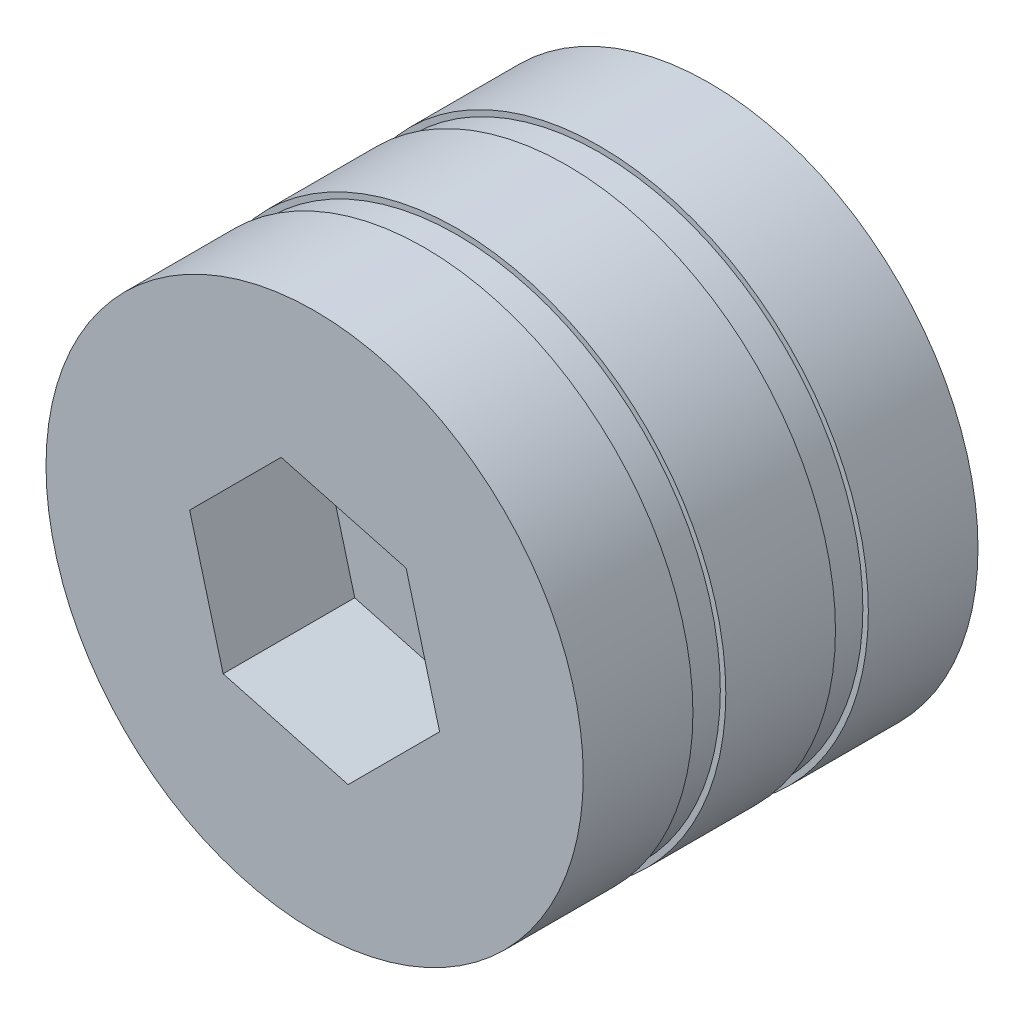
ISO-10303-21;
HEADER;
FILE_DESCRIPTION(('STEP AP214'),'2;1');
FILE_NAME('part.step','',(''),(''),'','','');
FILE_SCHEMA(('AUTOMOTIVE_DESIGN { 1 0 10303 214 1 1 1 1 }'));
ENDSEC;
DATA;
#1=APPLICATION_CONTEXT('core data for automotive mechanical design processes');
#2=APPLICATION_PROTOCOL_DEFINITION('international standard','automotive_design',2000,#1);
#3=PRODUCT_CONTEXT('',#1,'mechanical');
#4=PRODUCT('Part','Part','',(#3));
#5=PRODUCT_RELATED_PRODUCT_CATEGORY('part','',(#4));
#6=PRODUCT_DEFINITION_FORMATION('','',#4);
#7=PRODUCT_DEFINITION_CONTEXT('part definition',#1,'design');
#8=PRODUCT_DEFINITION('design','',#6,#7);
#9=PRODUCT_DEFINITION_SHAPE('','',#8);
#10=(LENGTH_UNIT() NAMED_UNIT(*) SI_UNIT(.MILLI.,.METRE.));
#11=(NAMED_UNIT(*) PLANE_ANGLE_UNIT() SI_UNIT($,.RADIAN.));
#12=(NAMED_UNIT(*) SI_UNIT($,.STERADIAN.) SOLID_ANGLE_UNIT());
#13=UNCERTAINTY_MEASURE_WITH_UNIT(LENGTH_MEASURE(1.E-05),#10,'distance_accuracy_value','');
#14=(GEOMETRIC_REPRESENTATION_CONTEXT(3) GLOBAL_UNCERTAINTY_ASSIGNED_CONTEXT((#13)) GLOBAL_UNIT_ASSIGNED_CONTEXT((#10,
#11,#12)) REPRESENTATION_CONTEXT('',''));
#15=CARTESIAN_POINT('',(0.,0.,0.));
#16=DIRECTION('',(0.,0.,1.));
#17=DIRECTION('',(1.,0.,0.));
#18=AXIS2_PLACEMENT_3D('',#15,#16,#17);
#19=CARTESIAN_POINT('',(0.,0.,36.));
#20=DIRECTION('',(0.,0.,-1.));
#21=DIRECTION('',(-1.,0.,0.));
#22=AXIS2_PLACEMENT_3D('',#19,#20,#21);
#23=CYLINDRICAL_SURFACE('',#22,24.5);
#24=CARTESIAN_POINT('',(0.,0.,26.));
#25=DIRECTION('',(0.,0.,1.));
#26=DIRECTION('',(1.,0.,0.));
#27=AXIS2_PLACEMENT_3D('',#24,#25,#26);
#28=CIRCLE('',#27,24.5);
#29=CARTESIAN_POINT('',(24.5,0.,26.));
#30=VERTEX_POINT('',#29);
#31=EDGE_CURVE('E155',#30,#30,#28,.T.);
#32=ORIENTED_EDGE('',*,*,#31,.T.);
#33=EDGE_LOOP('',(#32));
#34=FACE_BOUND('',#33,.T.);
#35=CARTESIAN_POINT('',(0.,0.,36.));
#36=DIRECTION('',(0.,0.,1.));
#37=DIRECTION('',(1.,0.,0.));
#38=AXIS2_PLACEMENT_3D('',#35,#36,#37);
#39=CIRCLE('',#38,24.5);
#40=CARTESIAN_POINT('',(24.5,0.,36.));
#41=VERTEX_POINT('',#40);
#42=EDGE_CURVE('E11',#41,#41,#39,.T.);
#43=ORIENTED_EDGE('',*,*,#42,.F.);
#44=EDGE_LOOP('',(#43));
#45=FACE_BOUND('',#44,.T.);
#46=ADVANCED_FACE('F37',(#34,#45),#23,.T.);
#47=CARTESIAN_POINT('',(0.,0.,36.));
#48=DIRECTION('',(0.,0.,1.));
#49=DIRECTION('',(1.,0.,0.));
#50=AXIS2_PLACEMENT_3D('',#47,#48,#49);
#51=PLANE('',#50);
#52=DIRECTION('',(-0.258819045102521,0.965925826289068,0.));
#53=VECTOR('',#52,1.);
#54=CARTESIAN_POINT('',(11.397924750211,-3.05406473220975,36.));
#55=LINE('',#54,#53);
#56=CARTESIAN_POINT('',(11.397924750211,-3.05406473220975,36.));
#57=VERTEX_POINT('',#56);
#58=CARTESIAN_POINT('',(8.34386001800126,8.34386001800126,36.));
#59=VERTEX_POINT('',#58);
#60=EDGE_CURVE('E51',#57,#59,#55,.T.);
#61=ORIENTED_EDGE('',*,*,#60,.F.);
#62=DIRECTION('',(0.707106781186547,0.707106781186548,0.));
#63=VECTOR('',#62,1.);
#64=CARTESIAN_POINT('',(3.05406473220975,-11.397924750211,36.));
#65=LINE('',#64,#63);
#66=CARTESIAN_POINT('',(3.05406473220975,-11.397924750211,36.));
#67=VERTEX_POINT('',#66);
#68=EDGE_CURVE('E135',#67,#57,#65,.T.);
#69=ORIENTED_EDGE('',*,*,#68,.F.);
#70=DIRECTION('',(0.965925826289068,-0.258819045102521,0.));
#71=VECTOR('',#70,1.);
#72=CARTESIAN_POINT('',(-8.34386001800126,-8.34386001800126,36.));
#73=LINE('',#72,#71);
#74=CARTESIAN_POINT('',(-8.34386001800126,-8.34386001800126,36.));
#75=VERTEX_POINT('',#74);
#76=EDGE_CURVE('E133',#75,#67,#73,.T.);
#77=ORIENTED_EDGE('',*,*,#76,.F.);
#78=DIRECTION('',(0.258819045102521,-0.965925826289068,0.));
#79=VECTOR('',#78,1.);
#80=CARTESIAN_POINT('',(-11.397924750211,3.05406473220974,36.));
#81=LINE('',#80,#79);
#82=CARTESIAN_POINT('',(-11.397924750211,3.05406473220974,36.));
#83=VERTEX_POINT('',#82);
#84=EDGE_CURVE('E99',#83,#75,#81,.T.);
#85=ORIENTED_EDGE('',*,*,#84,.F.);
#86=DIRECTION('',(-0.707106781186547,-0.707106781186547,0.));
#87=VECTOR('',#86,1.);
#88=CARTESIAN_POINT('',(-3.05406473220974,11.397924750211,36.));
#89=LINE('',#88,#87);
#90=CARTESIAN_POINT('',(-3.05406473220974,11.397924750211,36.));
#91=VERTEX_POINT('',#90);
#92=EDGE_CURVE('E129',#91,#83,#89,.T.);
#93=ORIENTED_EDGE('',*,*,#92,.F.);
#94=DIRECTION('',(-0.965925826289068,0.258819045102521,0.));
#95=VECTOR('',#94,1.);
#96=CARTESIAN_POINT('',(8.34386001800126,8.34386001800126,36.));
#97=LINE('',#96,#95);
#98=EDGE_CURVE('E125',#59,#91,#97,.T.);
#99=ORIENTED_EDGE('',*,*,#98,.F.);
#100=EDGE_LOOP('',(#61,#69,#77,#85,#93,#99));
#101=FACE_BOUND('',#100,.T.);
#102=ORIENTED_EDGE('',*,*,#42,.T.);
#103=EDGE_LOOP('',(#102));
#104=FACE_BOUND('',#103,.T.);
#105=ADVANCED_FACE('F148',(#101,#104),#51,.T.);
#106=CARTESIAN_POINT('',(11.397924750211,-3.05406473220975,24.));
#107=DIRECTION('',(0.965925826289068,0.258819045102521,0.));
#108=DIRECTION('',(-0.258819045102521,0.965925826289068,0.));
#109=AXIS2_PLACEMENT_3D('',#106,#107,#108);
#110=PLANE('',#109);
#111=ORIENTED_EDGE('',*,*,#60,.T.);
#112=DIRECTION('',(0.,0.,1.));
#113=VECTOR('',#112,1.);
#114=CARTESIAN_POINT('',(8.34386001800126,8.34386001800126,24.));
#115=LINE('',#114,#113);
#116=CARTESIAN_POINT('',(8.34386001800126,8.34386001800126,24.));
#117=VERTEX_POINT('',#116);
#118=EDGE_CURVE('E81',#117,#59,#115,.T.);
#119=ORIENTED_EDGE('',*,*,#118,.F.);
#120=DIRECTION('',(-0.258819045102521,0.965925826289068,0.));
#121=VECTOR('',#120,1.);
#122=CARTESIAN_POINT('',(11.397924750211,-3.05406473220975,24.));
#123=LINE('',#122,#121);
#124=CARTESIAN_POINT('',(11.397924750211,-3.05406473220975,24.));
#125=VERTEX_POINT('',#124);
#126=EDGE_CURVE('E137',#125,#117,#123,.T.);
#127=ORIENTED_EDGE('',*,*,#126,.F.);
#128=DIRECTION('',(0.,0.,1.));
#129=VECTOR('',#128,1.);
#130=CARTESIAN_POINT('',(11.397924750211,-3.05406473220975,24.));
#131=LINE('',#130,#129);
#132=EDGE_CURVE('E59',#125,#57,#131,.T.);
#133=ORIENTED_EDGE('',*,*,#132,.T.);
#134=EDGE_LOOP('',(#111,#119,#127,#133));
#135=FACE_BOUND('',#134,.T.);
#136=ADVANCED_FACE('F207',(#135),#110,.F.);
#137=CARTESIAN_POINT('',(3.05406473220975,-11.397924750211,24.));
#138=DIRECTION('',(0.707106781186548,-0.707106781186547,0.));
#139=DIRECTION('',(0.707106781186547,0.707106781186548,0.));
#140=AXIS2_PLACEMENT_3D('',#137,#138,#139);
#141=PLANE('',#140);
#142=ORIENTED_EDGE('',*,*,#68,.T.);
#143=ORIENTED_EDGE('',*,*,#132,.F.);
#144=DIRECTION('',(0.707106781186547,0.707106781186548,0.));
#145=VECTOR('',#144,1.);
#146=CARTESIAN_POINT('',(3.05406473220975,-11.397924750211,24.));
#147=LINE('',#146,#145);
#148=CARTESIAN_POINT('',(3.05406473220975,-11.397924750211,24.));
#149=VERTEX_POINT('',#148);
#150=EDGE_CURVE('E111',#149,#125,#147,.T.);
#151=ORIENTED_EDGE('',*,*,#150,.F.);
#152=DIRECTION('',(0.,0.,1.));
#153=VECTOR('',#152,1.);
#154=CARTESIAN_POINT('',(3.05406473220975,-11.397924750211,24.));
#155=LINE('',#154,#153);
#156=EDGE_CURVE('E103',#149,#67,#155,.T.);
#157=ORIENTED_EDGE('',*,*,#156,.T.);
#158=EDGE_LOOP('',(#142,#143,#151,#157));
#159=FACE_BOUND('',#158,.T.);
#160=ADVANCED_FACE('F229',(#159),#141,.F.);
#161=CARTESIAN_POINT('',(-8.34386001800126,-8.34386001800126,24.));
#162=DIRECTION('',(-0.258819045102521,-0.965925826289068,0.));
#163=DIRECTION('',(0.965925826289068,-0.258819045102521,0.));
#164=AXIS2_PLACEMENT_3D('',#161,#162,#163);
#165=PLANE('',#164);
#166=ORIENTED_EDGE('',*,*,#76,.T.);
#167=ORIENTED_EDGE('',*,*,#156,.F.);
#168=DIRECTION('',(0.965925826289068,-0.258819045102521,0.));
#169=VECTOR('',#168,1.);
#170=CARTESIAN_POINT('',(-8.34386001800126,-8.34386001800126,24.));
#171=LINE('',#170,#169);
#172=CARTESIAN_POINT('',(-8.34386001800126,-8.34386001800126,24.));
#173=VERTEX_POINT('',#172);
#174=EDGE_CURVE('E107',#173,#149,#171,.T.);
#175=ORIENTED_EDGE('',*,*,#174,.F.);
#176=DIRECTION('',(0.,0.,1.));
#177=VECTOR('',#176,1.);
#178=CARTESIAN_POINT('',(-8.34386001800126,-8.34386001800126,24.));
#179=LINE('',#178,#177);
#180=EDGE_CURVE('E92',#173,#75,#179,.T.);
#181=ORIENTED_EDGE('',*,*,#180,.T.);
#182=EDGE_LOOP('',(#166,#167,#175,#181));
#183=FACE_BOUND('',#182,.T.);
#184=ADVANCED_FACE('F108',(#183),#165,.F.);
#185=CARTESIAN_POINT('',(-11.397924750211,3.05406473220974,24.));
#186=DIRECTION('',(-0.965925826289068,-0.258819045102521,0.));
#187=DIRECTION('',(0.258819045102521,-0.965925826289068,0.));
#188=AXIS2_PLACEMENT_3D('',#185,#186,#187);
#189=PLANE('',#188);
#190=ORIENTED_EDGE('',*,*,#84,.T.);
#191=ORIENTED_EDGE('',*,*,#180,.F.);
#192=DIRECTION('',(0.258819045102521,-0.965925826289068,0.));
#193=VECTOR('',#192,1.);
#194=CARTESIAN_POINT('',(-11.397924750211,3.05406473220974,24.));
#195=LINE('',#194,#193);
#196=CARTESIAN_POINT('',(-11.397924750211,3.05406473220974,24.));
#197=VERTEX_POINT('',#196);
#198=EDGE_CURVE('E96',#197,#173,#195,.T.);
#199=ORIENTED_EDGE('',*,*,#198,.F.);
#200=DIRECTION('',(0.,0.,1.));
#201=VECTOR('',#200,1.);
#202=CARTESIAN_POINT('',(-11.397924750211,3.05406473220974,24.));
#203=LINE('',#202,#201);
#204=EDGE_CURVE('E104',#197,#83,#203,.T.);
#205=ORIENTED_EDGE('',*,*,#204,.T.);
#206=EDGE_LOOP('',(#190,#191,#199,#205));
#207=FACE_BOUND('',#206,.T.);
#208=ADVANCED_FACE('F94',(#207),#189,.F.);
#209=CARTESIAN_POINT('',(-3.05406473220974,11.397924750211,24.));
#210=DIRECTION('',(-0.707106781186548,0.707106781186548,0.));
#211=DIRECTION('',(-0.707106781186548,-0.707106781186548,0.));
#212=AXIS2_PLACEMENT_3D('',#209,#210,#211);
#213=PLANE('',#212);
#214=ORIENTED_EDGE('',*,*,#92,.T.);
#215=ORIENTED_EDGE('',*,*,#204,.F.);
#216=DIRECTION('',(-0.707106781186547,-0.707106781186547,0.));
#217=VECTOR('',#216,1.);
#218=CARTESIAN_POINT('',(-3.05406473220974,11.397924750211,24.));
#219=LINE('',#218,#217);
#220=CARTESIAN_POINT('',(-3.05406473220974,11.397924750211,24.));
#221=VERTEX_POINT('',#220);
#222=EDGE_CURVE('E117',#221,#197,#219,.T.);
#223=ORIENTED_EDGE('',*,*,#222,.F.);
#224=DIRECTION('',(0.,0.,1.));
#225=VECTOR('',#224,1.);
#226=CARTESIAN_POINT('',(-3.05406473220974,11.397924750211,24.));
#227=LINE('',#226,#225);
#228=EDGE_CURVE('E141',#221,#91,#227,.T.);
#229=ORIENTED_EDGE('',*,*,#228,.T.);
#230=EDGE_LOOP('',(#214,#215,#223,#229));
#231=FACE_BOUND('',#230,.T.);
#232=ADVANCED_FACE('F152',(#231),#213,.F.);
#233=CARTESIAN_POINT('',(8.34386001800126,8.34386001800126,24.));
#234=DIRECTION('',(0.258819045102521,0.965925826289068,0.));
#235=DIRECTION('',(-0.965925826289068,0.258819045102521,0.));
#236=AXIS2_PLACEMENT_3D('',#233,#234,#235);
#237=PLANE('',#236);
#238=ORIENTED_EDGE('',*,*,#98,.T.);
#239=ORIENTED_EDGE('',*,*,#228,.F.);
#240=DIRECTION('',(-0.965925826289068,0.258819045102521,0.));
#241=VECTOR('',#240,1.);
#242=CARTESIAN_POINT('',(8.34386001800126,8.34386001800126,24.));
#243=LINE('',#242,#241);
#244=EDGE_CURVE('E119',#117,#221,#243,.T.);
#245=ORIENTED_EDGE('',*,*,#244,.F.);
#246=ORIENTED_EDGE('',*,*,#118,.T.);
#247=EDGE_LOOP('',(#238,#239,#245,#246));
#248=FACE_BOUND('',#247,.T.);
#249=ADVANCED_FACE('F145',(#248),#237,.F.);
#250=CARTESIAN_POINT('',(0.,0.,24.));
#251=DIRECTION('',(0.,0.,1.));
#252=DIRECTION('',(1.,0.,0.));
#253=AXIS2_PLACEMENT_3D('',#250,#251,#252);
#254=PLANE('',#253);
#255=ORIENTED_EDGE('',*,*,#126,.T.);
#256=ORIENTED_EDGE('',*,*,#244,.T.);
#257=ORIENTED_EDGE('',*,*,#222,.T.);
#258=ORIENTED_EDGE('',*,*,#198,.T.);
#259=ORIENTED_EDGE('',*,*,#174,.T.);
#260=ORIENTED_EDGE('',*,*,#150,.T.);
#261=EDGE_LOOP('',(#255,#256,#257,#258,#259,#260));
#262=FACE_BOUND('',#261,.T.);
#263=ADVANCED_FACE('F114',(#262),#254,.T.);
#264=CARTESIAN_POINT('',(0.,0.,23.));
#265=DIRECTION('',(0.,0.,1.));
#266=DIRECTION('',(1.,0.,0.));
#267=AXIS2_PLACEMENT_3D('',#264,#265,#266);
#268=PLANE('',#267);
#269=CARTESIAN_POINT('',(0.,0.,23.));
#270=DIRECTION('',(0.,0.,1.));
#271=DIRECTION('',(1.,0.,0.));
#272=AXIS2_PLACEMENT_3D('',#269,#270,#271);
#273=CIRCLE('',#272,24.);
#274=CARTESIAN_POINT('',(24.,0.,23.));
#275=VERTEX_POINT('',#274);
#276=EDGE_CURVE('E158',#275,#275,#273,.T.);
#277=ORIENTED_EDGE('',*,*,#276,.F.);
#278=EDGE_LOOP('',(#277));
#279=FACE_BOUND('',#278,.T.);
#280=CARTESIAN_POINT('',(0.,0.,23.));
#281=DIRECTION('',(0.,0.,1.));
#282=DIRECTION('',(1.,0.,0.));
#283=AXIS2_PLACEMENT_3D('',#280,#281,#282);
#284=CIRCLE('',#283,24.5);
#285=CARTESIAN_POINT('',(24.5,0.,23.));
#286=VERTEX_POINT('',#285);
#287=EDGE_CURVE('E126',#286,#286,#284,.T.);
#288=ORIENTED_EDGE('',*,*,#287,.T.);
#289=EDGE_LOOP('',(#288));
#290=FACE_BOUND('',#289,.T.);
#291=ADVANCED_FACE('F215',(#279,#290),#268,.T.);
#292=CARTESIAN_POINT('',(0.,0.,26.));
#293=DIRECTION('',(0.,0.,1.));
#294=DIRECTION('',(1.,0.,0.));
#295=AXIS2_PLACEMENT_3D('',#292,#293,#294);
#296=PLANE('',#295);
#297=CARTESIAN_POINT('',(0.,0.,26.));
#298=DIRECTION('',(0.,0.,1.));
#299=DIRECTION('',(1.,0.,0.));
#300=AXIS2_PLACEMENT_3D('',#297,#298,#299);
#301=CIRCLE('',#300,24.);
#302=CARTESIAN_POINT('',(24.,0.,26.));
#303=VERTEX_POINT('',#302);
#304=EDGE_CURVE('E161',#303,#303,#301,.T.);
#305=ORIENTED_EDGE('',*,*,#304,.T.);
#306=EDGE_LOOP('',(#305));
#307=FACE_BOUND('',#306,.T.);
#308=ORIENTED_EDGE('',*,*,#31,.F.);
#309=EDGE_LOOP('',(#308));
#310=FACE_BOUND('',#309,.T.);
#311=ADVANCED_FACE('F213',(#307,#310),#296,.F.);
#312=CARTESIAN_POINT('',(0.,0.,23.));
#313=DIRECTION('',(0.,0.,1.));
#314=DIRECTION('',(1.,0.,0.));
#315=AXIS2_PLACEMENT_3D('',#312,#313,#314);
#316=CYLINDRICAL_SURFACE('',#315,24.);
#317=ORIENTED_EDGE('',*,*,#276,.T.);
#318=EDGE_LOOP('',(#317));
#319=FACE_BOUND('',#318,.T.);
#320=ORIENTED_EDGE('',*,*,#304,.F.);
#321=EDGE_LOOP('',(#320));
#322=FACE_BOUND('',#321,.T.);
#323=ADVANCED_FACE('F200',(#319,#322),#316,.T.);
#324=CARTESIAN_POINT('',(0.,0.,13.));
#325=DIRECTION('',(0.,0.,1.));
#326=DIRECTION('',(1.,0.,0.));
#327=AXIS2_PLACEMENT_3D('',#324,#325,#326);
#328=CIRCLE('',#327,24.5);
#329=CARTESIAN_POINT('',(24.5,0.,13.));
#330=VERTEX_POINT('',#329);
#331=EDGE_CURVE('E167',#330,#330,#328,.T.);
#332=ORIENTED_EDGE('',*,*,#331,.T.);
#333=EDGE_LOOP('',(#332));
#334=FACE_BOUND('',#333,.T.);
#335=ORIENTED_EDGE('',*,*,#287,.F.);
#336=EDGE_LOOP('',(#335));
#337=FACE_BOUND('',#336,.T.);
#338=ADVANCED_FACE('F186',(#334,#337),#23,.T.);
#339=CARTESIAN_POINT('',(0.,0.,10.));
#340=DIRECTION('',(0.,0.,1.));
#341=DIRECTION('',(1.,0.,0.));
#342=AXIS2_PLACEMENT_3D('',#339,#340,#341);
#343=PLANE('',#342);
#344=CARTESIAN_POINT('',(0.,0.,10.));
#345=DIRECTION('',(0.,0.,1.));
#346=DIRECTION('',(1.,0.,0.));
#347=AXIS2_PLACEMENT_3D('',#344,#345,#346);
#348=CIRCLE('',#347,24.);
#349=CARTESIAN_POINT('',(24.,0.,10.));
#350=VERTEX_POINT('',#349);
#351=EDGE_CURVE('E170',#350,#350,#348,.T.);
#352=ORIENTED_EDGE('',*,*,#351,.F.);
#353=EDGE_LOOP('',(#352));
#354=FACE_BOUND('',#353,.T.);
#355=CARTESIAN_POINT('',(0.,0.,10.));
#356=DIRECTION('',(0.,0.,1.));
#357=DIRECTION('',(1.,0.,0.));
#358=AXIS2_PLACEMENT_3D('',#355,#356,#357);
#359=CIRCLE('',#358,24.5);
#360=CARTESIAN_POINT('',(24.5,0.,10.));
#361=VERTEX_POINT('',#360);
#362=EDGE_CURVE('E164',#361,#361,#359,.T.);
#363=ORIENTED_EDGE('',*,*,#362,.T.);
#364=EDGE_LOOP('',(#363));
#365=FACE_BOUND('',#364,.T.);
#366=ADVANCED_FACE('F182',(#354,#365),#343,.T.);
#367=CARTESIAN_POINT('',(0.,0.,13.));
#368=DIRECTION('',(0.,0.,1.));
#369=DIRECTION('',(1.,0.,0.));
#370=AXIS2_PLACEMENT_3D('',#367,#368,#369);
#371=PLANE('',#370);
#372=CARTESIAN_POINT('',(0.,0.,13.));
#373=DIRECTION('',(0.,0.,1.));
#374=DIRECTION('',(1.,0.,0.));
#375=AXIS2_PLACEMENT_3D('',#372,#373,#374);
#376=CIRCLE('',#375,24.);
#377=CARTESIAN_POINT('',(24.,0.,13.));
#378=VERTEX_POINT('',#377);
#379=EDGE_CURVE('E173',#378,#378,#376,.T.);
#380=ORIENTED_EDGE('',*,*,#379,.T.);
#381=EDGE_LOOP('',(#380));
#382=FACE_BOUND('',#381,.T.);
#383=ORIENTED_EDGE('',*,*,#331,.F.);
#384=EDGE_LOOP('',(#383));
#385=FACE_BOUND('',#384,.T.);
#386=ADVANCED_FACE('F185',(#382,#385),#371,.F.);
#387=CARTESIAN_POINT('',(0.,0.,10.));
#388=DIRECTION('',(0.,0.,1.));
#389=DIRECTION('',(1.,0.,0.));
#390=AXIS2_PLACEMENT_3D('',#387,#388,#389);
#391=CYLINDRICAL_SURFACE('',#390,24.);
#392=ORIENTED_EDGE('',*,*,#351,.T.);
#393=EDGE_LOOP('',(#392));
#394=FACE_BOUND('',#393,.T.);
#395=ORIENTED_EDGE('',*,*,#379,.F.);
#396=EDGE_LOOP('',(#395));
#397=FACE_BOUND('',#396,.T.);
#398=ADVANCED_FACE('F179',(#394,#397),#391,.T.);
#399=CARTESIAN_POINT('',(0.,0.,0.));
#400=DIRECTION('',(0.,0.,1.));
#401=DIRECTION('',(1.,0.,0.));
#402=AXIS2_PLACEMENT_3D('',#399,#400,#401);
#403=PLANE('',#402);
#404=CARTESIAN_POINT('',(0.,0.,0.));
#405=DIRECTION('',(0.,0.,1.));
#406=DIRECTION('',(1.,0.,0.));
#407=AXIS2_PLACEMENT_3D('',#404,#405,#406);
#408=CIRCLE('',#407,24.5);
#409=CARTESIAN_POINT('',(24.5,0.,0.));
#410=VERTEX_POINT('',#409);
#411=EDGE_CURVE('E40',#410,#410,#408,.T.);
#412=ORIENTED_EDGE('',*,*,#411,.F.);
#413=EDGE_LOOP('',(#412));
#414=FACE_BOUND('',#413,.T.);
#415=ADVANCED_FACE('F192',(#414),#403,.F.);
#416=ORIENTED_EDGE('',*,*,#411,.T.);
#417=EDGE_LOOP('',(#416));
#418=FACE_BOUND('',#417,.T.);
#419=ORIENTED_EDGE('',*,*,#362,.F.);
#420=EDGE_LOOP('',(#419));
#421=FACE_BOUND('',#420,.T.);
#422=ADVANCED_FACE('F190',(#418,#421),#23,.T.);
#423=CLOSED_SHELL('',(#46,#105,#136,#160,#184,#208,#232,#249,#263,#291,#311,#323,#338,#366,#386,
#398,#415,#422));
#424=MANIFOLD_SOLID_BREP('B2',#423);
#425=ADVANCED_BREP_SHAPE_REPRESENTATION('',(#18,#424),#14);
#426=SHAPE_DEFINITION_REPRESENTATION(#9,#425);
ENDSEC;
END-ISO-10303-21;
